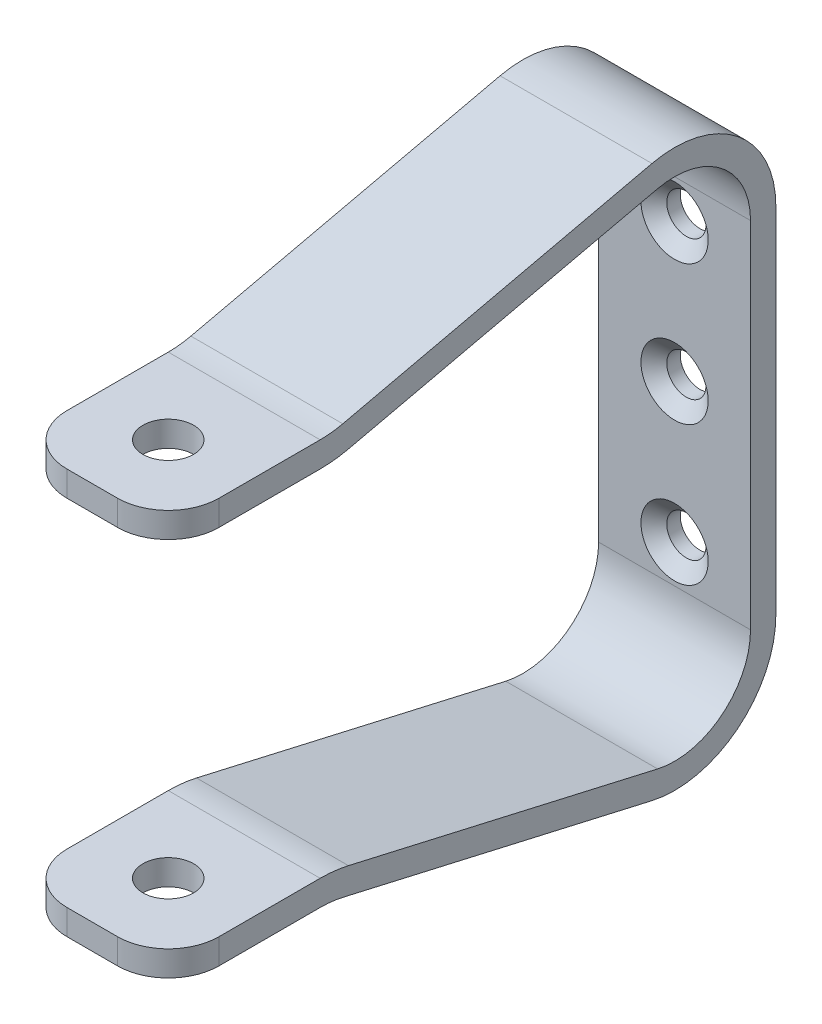
ISO-10303-21;
HEADER;
FILE_DESCRIPTION(('STEP AP214'),'2;1');
FILE_NAME('part.step','',(''),(''),'','','');
FILE_SCHEMA(('AUTOMOTIVE_DESIGN { 1 0 10303 214 1 1 1 1 }'));
ENDSEC;
DATA;
#1=APPLICATION_CONTEXT('core data for automotive mechanical design processes');
#2=APPLICATION_PROTOCOL_DEFINITION('international standard','automotive_design',2000,#1);
#3=PRODUCT_CONTEXT('',#1,'mechanical');
#4=PRODUCT('Part','Part','',(#3));
#5=PRODUCT_RELATED_PRODUCT_CATEGORY('part','',(#4));
#6=PRODUCT_DEFINITION_FORMATION('','',#4);
#7=PRODUCT_DEFINITION_CONTEXT('part definition',#1,'design');
#8=PRODUCT_DEFINITION('design','',#6,#7);
#9=PRODUCT_DEFINITION_SHAPE('','',#8);
#10=(LENGTH_UNIT() NAMED_UNIT(*) SI_UNIT(.MILLI.,.METRE.));
#11=(NAMED_UNIT(*) PLANE_ANGLE_UNIT() SI_UNIT($,.RADIAN.));
#12=(NAMED_UNIT(*) SI_UNIT($,.STERADIAN.) SOLID_ANGLE_UNIT());
#13=UNCERTAINTY_MEASURE_WITH_UNIT(LENGTH_MEASURE(1.E-05),#10,'distance_accuracy_value','');
#14=(GEOMETRIC_REPRESENTATION_CONTEXT(3) GLOBAL_UNCERTAINTY_ASSIGNED_CONTEXT((#13)) GLOBAL_UNIT_ASSIGNED_CONTEXT((#10,
#11,#12)) REPRESENTATION_CONTEXT('',''));
#15=CARTESIAN_POINT('',(0.,0.,0.));
#16=DIRECTION('',(0.,0.,1.));
#17=DIRECTION('',(1.,0.,0.));
#18=AXIS2_PLACEMENT_3D('',#15,#16,#17);
#19=CARTESIAN_POINT('',(9.52499999999998,25.4,57.15));
#20=DIRECTION('',(0.,-1.,0.));
#21=DIRECTION('',(1.,0.,0.));
#22=AXIS2_PLACEMENT_3D('',#19,#20,#21);
#23=PLANE('',#22);
#24=CARTESIAN_POINT('',(0.,25.4,66.675));
#25=DIRECTION('',(0.,-1.,0.));
#26=DIRECTION('',(1.,0.,0.));
#27=AXIS2_PLACEMENT_3D('',#24,#25,#26);
#28=CIRCLE('',#27,3.175);
#29=CARTESIAN_POINT('',(3.175,25.4,66.675));
#30=VERTEX_POINT('',#29);
#31=EDGE_CURVE('E245',#30,#30,#28,.T.);
#32=ORIENTED_EDGE('',*,*,#31,.T.);
#33=EDGE_LOOP('',(#32));
#34=FACE_BOUND('',#33,.T.);
#35=DIRECTION('',(-1.,0.,0.));
#36=VECTOR('',#35,1.);
#37=CARTESIAN_POINT('',(9.52499999999997,25.4,76.2));
#38=LINE('',#37,#36);
#39=CARTESIAN_POINT('',(3.17499999999997,25.4,76.2));
#40=VERTEX_POINT('',#39);
#41=CARTESIAN_POINT('',(-3.17500000000003,25.4,76.2));
#42=VERTEX_POINT('',#41);
#43=EDGE_CURVE('E353',#40,#42,#38,.T.);
#44=ORIENTED_EDGE('',*,*,#43,.F.);
#45=CARTESIAN_POINT('',(3.17499999999997,25.4,69.85));
#46=DIRECTION('',(0.,-1.,0.));
#47=DIRECTION('',(1.,0.,0.));
#48=AXIS2_PLACEMENT_3D('',#45,#46,#47);
#49=CIRCLE('',#48,6.35);
#50=CARTESIAN_POINT('',(9.52499999999997,25.4,69.85));
#51=VERTEX_POINT('',#50);
#52=EDGE_CURVE('E368',#40,#51,#49,.F.);
#53=ORIENTED_EDGE('',*,*,#52,.T.);
#54=DIRECTION('',(0.,0.,1.));
#55=VECTOR('',#54,1.);
#56=CARTESIAN_POINT('',(9.52499999999998,25.4,57.15));
#57=LINE('',#56,#55);
#58=CARTESIAN_POINT('',(9.52499999999998,25.4,57.15));
#59=VERTEX_POINT('',#58);
#60=EDGE_CURVE('E275',#59,#51,#57,.T.);
#61=ORIENTED_EDGE('',*,*,#60,.F.);
#62=DIRECTION('',(-1.,0.,0.));
#63=VECTOR('',#62,1.);
#64=CARTESIAN_POINT('',(9.52499999999998,25.4,57.15));
#65=LINE('',#64,#63);
#66=CARTESIAN_POINT('',(-9.52500000000002,25.4,57.15));
#67=VERTEX_POINT('',#66);
#68=EDGE_CURVE('E301',#59,#67,#65,.T.);
#69=ORIENTED_EDGE('',*,*,#68,.T.);
#70=DIRECTION('',(0.,0.,1.));
#71=VECTOR('',#70,1.);
#72=CARTESIAN_POINT('',(-9.52500000000002,25.4,57.15));
#73=LINE('',#72,#71);
#74=CARTESIAN_POINT('',(-9.52500000000003,25.4,69.85));
#75=VERTEX_POINT('',#74);
#76=EDGE_CURVE('E209',#67,#75,#73,.T.);
#77=ORIENTED_EDGE('',*,*,#76,.T.);
#78=CARTESIAN_POINT('',(-3.17500000000003,25.4,69.85));
#79=DIRECTION('',(0.,-1.,0.));
#80=DIRECTION('',(1.,0.,0.));
#81=AXIS2_PLACEMENT_3D('',#78,#79,#80);
#82=CIRCLE('',#81,6.35);
#83=EDGE_CURVE('E366',#75,#42,#82,.F.);
#84=ORIENTED_EDGE('',*,*,#83,.T.);
#85=EDGE_LOOP('',(#44,#53,#61,#69,#77,#84));
#86=FACE_BOUND('',#85,.T.);
#87=ADVANCED_FACE('F37',(#34,#86),#23,.F.);
#88=CARTESIAN_POINT('',(9.52499999999997,22.225,76.2));
#89=DIRECTION('',(0.,0.,1.));
#90=DIRECTION('',(1.,0.,0.));
#91=AXIS2_PLACEMENT_3D('',#88,#89,#90);
#92=PLANE('',#91);
#93=DIRECTION('',(-1.,0.,0.));
#94=VECTOR('',#93,1.);
#95=CARTESIAN_POINT('',(9.52499999999997,22.225,76.2));
#96=LINE('',#95,#94);
#97=CARTESIAN_POINT('',(3.17499999999997,22.225,76.2));
#98=VERTEX_POINT('',#97);
#99=CARTESIAN_POINT('',(-3.17500000000003,22.225,76.2));
#100=VERTEX_POINT('',#99);
#101=EDGE_CURVE('E350',#98,#100,#96,.T.);
#102=ORIENTED_EDGE('',*,*,#101,.F.);
#103=DIRECTION('',(0.,1.,0.));
#104=VECTOR('',#103,1.);
#105=CARTESIAN_POINT('',(3.17499999999997,22.225,76.2));
#106=LINE('',#105,#104);
#107=EDGE_CURVE('E363',#98,#40,#106,.T.);
#108=ORIENTED_EDGE('',*,*,#107,.T.);
#109=ORIENTED_EDGE('',*,*,#43,.T.);
#110=DIRECTION('',(0.,1.,0.));
#111=VECTOR('',#110,1.);
#112=CARTESIAN_POINT('',(-3.17500000000003,22.225,76.2));
#113=LINE('',#112,#111);
#114=EDGE_CURVE('E356',#42,#100,#113,.F.);
#115=ORIENTED_EDGE('',*,*,#114,.T.);
#116=EDGE_LOOP('',(#102,#108,#109,#115));
#117=FACE_BOUND('',#116,.T.);
#118=ADVANCED_FACE('F440',(#117),#92,.T.);
#119=CARTESIAN_POINT('',(9.52499999999998,22.225,57.15));
#120=DIRECTION('',(0.,-1.,0.));
#121=DIRECTION('',(1.,0.,0.));
#122=AXIS2_PLACEMENT_3D('',#119,#120,#121);
#123=PLANE('',#122);
#124=CARTESIAN_POINT('',(0.,22.225,66.675));
#125=DIRECTION('',(0.,-1.,0.));
#126=DIRECTION('',(1.,0.,0.));
#127=AXIS2_PLACEMENT_3D('',#124,#125,#126);
#128=CIRCLE('',#127,3.175);
#129=CARTESIAN_POINT('',(3.175,22.225,66.675));
#130=VERTEX_POINT('',#129);
#131=EDGE_CURVE('E360',#130,#130,#128,.T.);
#132=ORIENTED_EDGE('',*,*,#131,.F.);
#133=EDGE_LOOP('',(#132));
#134=FACE_BOUND('',#133,.T.);
#135=DIRECTION('',(0.,0.,1.));
#136=VECTOR('',#135,1.);
#137=CARTESIAN_POINT('',(9.52499999999998,22.225,57.15));
#138=LINE('',#137,#136);
#139=CARTESIAN_POINT('',(9.52499999999998,22.225,57.15));
#140=VERTEX_POINT('',#139);
#141=CARTESIAN_POINT('',(9.52499999999997,22.225,69.85));
#142=VERTEX_POINT('',#141);
#143=EDGE_CURVE('E277',#140,#142,#138,.T.);
#144=ORIENTED_EDGE('',*,*,#143,.T.);
#145=CARTESIAN_POINT('',(3.17499999999997,22.225,69.85));
#146=DIRECTION('',(0.,-1.,0.));
#147=DIRECTION('',(1.,0.,0.));
#148=AXIS2_PLACEMENT_3D('',#145,#146,#147);
#149=CIRCLE('',#148,6.35);
#150=EDGE_CURVE('E375',#142,#98,#149,.T.);
#151=ORIENTED_EDGE('',*,*,#150,.T.);
#152=ORIENTED_EDGE('',*,*,#101,.T.);
#153=CARTESIAN_POINT('',(-3.17500000000003,22.225,69.85));
#154=DIRECTION('',(0.,-1.,0.));
#155=DIRECTION('',(1.,0.,0.));
#156=AXIS2_PLACEMENT_3D('',#153,#154,#155);
#157=CIRCLE('',#156,6.35);
#158=CARTESIAN_POINT('',(-9.52500000000003,22.225,69.85));
#159=VERTEX_POINT('',#158);
#160=EDGE_CURVE('E373',#100,#159,#157,.T.);
#161=ORIENTED_EDGE('',*,*,#160,.T.);
#162=DIRECTION('',(0.,0.,1.));
#163=VECTOR('',#162,1.);
#164=CARTESIAN_POINT('',(-9.52500000000002,22.225,57.15));
#165=LINE('',#164,#163);
#166=CARTESIAN_POINT('',(-9.52500000000002,22.225,57.15));
#167=VERTEX_POINT('',#166);
#168=EDGE_CURVE('E304',#167,#159,#165,.T.);
#169=ORIENTED_EDGE('',*,*,#168,.F.);
#170=DIRECTION('',(-1.,0.,0.));
#171=VECTOR('',#170,1.);
#172=CARTESIAN_POINT('',(9.52499999999998,22.225,57.15));
#173=LINE('',#172,#171);
#174=EDGE_CURVE('E348',#140,#167,#173,.T.);
#175=ORIENTED_EDGE('',*,*,#174,.F.);
#176=EDGE_LOOP('',(#144,#151,#152,#161,#169,#175));
#177=FACE_BOUND('',#176,.T.);
#178=ADVANCED_FACE('F444',(#134,#177),#123,.T.);
#179=CARTESIAN_POINT('',(9.52499999999998,38.1,57.15));
#180=DIRECTION('',(-1.,0.,0.));
#181=DIRECTION('',(0.,0.,1.));
#182=AXIS2_PLACEMENT_3D('',#179,#180,#181);
#183=CYLINDRICAL_SURFACE('',#182,15.875);
#184=CARTESIAN_POINT('',(-9.52500000000003,38.1,57.15));
#185=DIRECTION('',(1.,0.,0.));
#186=DIRECTION('',(0.,-1.,0.));
#187=AXIS2_PLACEMENT_3D('',#184,#185,#186);
#188=CIRCLE('',#187,15.875);
#189=CARTESIAN_POINT('',(-9.52500000000002,22.6258619088462,53.6050493182692));
#190=VERTEX_POINT('',#189);
#191=EDGE_CURVE('E307',#190,#167,#188,.F.);
#192=ORIENTED_EDGE('',*,*,#191,.F.);
#193=DIRECTION('',(-1.,0.,0.));
#194=VECTOR('',#193,1.);
#195=CARTESIAN_POINT('',(9.52499999999998,22.6258619088462,53.6050493182692));
#196=LINE('',#195,#194);
#197=CARTESIAN_POINT('',(9.52499999999998,22.6258619088462,53.6050493182692));
#198=VERTEX_POINT('',#197);
#199=EDGE_CURVE('E346',#198,#190,#196,.T.);
#200=ORIENTED_EDGE('',*,*,#199,.F.);
#201=CARTESIAN_POINT('',(9.52499999999998,38.1,57.15));
#202=DIRECTION('',(1.,0.,0.));
#203=DIRECTION('',(0.,-1.,0.));
#204=AXIS2_PLACEMENT_3D('',#201,#202,#203);
#205=CIRCLE('',#204,15.875);
#206=EDGE_CURVE('E281',#198,#140,#205,.F.);
#207=ORIENTED_EDGE('',*,*,#206,.T.);
#208=ORIENTED_EDGE('',*,*,#174,.T.);
#209=EDGE_LOOP('',(#192,#200,#207,#208));
#210=FACE_BOUND('',#209,.T.);
#211=ADVANCED_FACE('F454',(#210),#183,.T.);
#212=CARTESIAN_POINT('',(9.525,31.5094828546923,14.8269704090385));
#213=DIRECTION('',(0.,-0.974748856135671,-0.223303979951546));
#214=DIRECTION('',(0.,0.223303979951546,-0.974748856135671));
#215=AXIS2_PLACEMENT_3D('',#212,#213,#214);
#216=PLANE('',#215);
#217=DIRECTION('',(0.,-0.223303979951546,0.974748856135671));
#218=VECTOR('',#217,1.);
#219=CARTESIAN_POINT('',(-9.525,31.5094828546922,14.8269704090385));
#220=LINE('',#219,#218);
#221=CARTESIAN_POINT('',(-9.525,31.5094828546922,14.8269704090385));
#222=VERTEX_POINT('',#221);
#223=EDGE_CURVE('E310',#222,#190,#220,.T.);
#224=ORIENTED_EDGE('',*,*,#223,.F.);
#225=DIRECTION('',(-1.,0.,0.));
#226=VECTOR('',#225,1.);
#227=CARTESIAN_POINT('',(9.525,31.5094828546923,14.8269704090385));
#228=LINE('',#227,#226);
#229=CARTESIAN_POINT('',(9.525,31.5094828546923,14.8269704090385));
#230=VERTEX_POINT('',#229);
#231=EDGE_CURVE('E344',#230,#222,#228,.T.);
#232=ORIENTED_EDGE('',*,*,#231,.F.);
#233=DIRECTION('',(0.,-0.223303979951546,0.974748856135671));
#234=VECTOR('',#233,1.);
#235=CARTESIAN_POINT('',(9.525,31.5094828546923,14.8269704090385));
#236=LINE('',#235,#234);
#237=EDGE_CURVE('E284',#230,#198,#236,.T.);
#238=ORIENTED_EDGE('',*,*,#237,.T.);
#239=ORIENTED_EDGE('',*,*,#199,.T.);
#240=EDGE_LOOP('',(#224,#232,#238,#239));
#241=FACE_BOUND('',#240,.T.);
#242=ADVANCED_FACE('F457',(#241),#216,.T.);
#243=CARTESIAN_POINT('',(9.525,22.225,12.7));
#244=DIRECTION('',(-1.,0.,0.));
#245=DIRECTION('',(0.,0.,1.));
#246=AXIS2_PLACEMENT_3D('',#243,#244,#245);
#247=CYLINDRICAL_SURFACE('',#246,9.525);
#248=CARTESIAN_POINT('',(-9.525,22.225,12.7));
#249=DIRECTION('',(1.,0.,0.));
#250=DIRECTION('',(0.,-1.,0.));
#251=AXIS2_PLACEMENT_3D('',#248,#249,#250);
#252=CIRCLE('',#251,9.525);
#253=CARTESIAN_POINT('',(-9.52499999999999,22.225,3.17500000000001));
#254=VERTEX_POINT('',#253);
#255=EDGE_CURVE('E313',#254,#222,#252,.T.);
#256=ORIENTED_EDGE('',*,*,#255,.F.);
#257=DIRECTION('',(-1.,0.,0.));
#258=VECTOR('',#257,1.);
#259=CARTESIAN_POINT('',(9.52500000000001,22.225,3.17500000000002));
#260=LINE('',#259,#258);
#261=CARTESIAN_POINT('',(9.52500000000001,22.225,3.17500000000002));
#262=VERTEX_POINT('',#261);
#263=EDGE_CURVE('E342',#262,#254,#260,.T.);
#264=ORIENTED_EDGE('',*,*,#263,.F.);
#265=CARTESIAN_POINT('',(9.525,22.225,12.7));
#266=DIRECTION('',(1.,0.,0.));
#267=DIRECTION('',(0.,-1.,0.));
#268=AXIS2_PLACEMENT_3D('',#265,#266,#267);
#269=CIRCLE('',#268,9.525);
#270=EDGE_CURVE('E287',#262,#230,#269,.T.);
#271=ORIENTED_EDGE('',*,*,#270,.T.);
#272=ORIENTED_EDGE('',*,*,#231,.T.);
#273=EDGE_LOOP('',(#256,#264,#271,#272));
#274=FACE_BOUND('',#273,.T.);
#275=ADVANCED_FACE('F462',(#274),#247,.F.);
#276=CARTESIAN_POINT('',(9.52500000000001,22.225,3.17500000000002));
#277=DIRECTION('',(0.,0.,1.));
#278=DIRECTION('',(1.,0.,0.));
#279=AXIS2_PLACEMENT_3D('',#276,#277,#278);
#280=PLANE('',#279);
#281=CARTESIAN_POINT('',(0.,-17.4625,3.175));
#282=DIRECTION('',(0.,0.,1.));
#283=DIRECTION('',(0.,-1.,0.));
#284=AXIS2_PLACEMENT_3D('',#281,#282,#283);
#285=CIRCLE('',#284,4.2164);
#286=CARTESIAN_POINT('',(0.,-21.6789,3.175));
#287=VERTEX_POINT('',#286);
#288=EDGE_CURVE('E880',#287,#287,#285,.T.);
#289=ORIENTED_EDGE('',*,*,#288,.F.);
#290=EDGE_LOOP('',(#289));
#291=FACE_BOUND('',#290,.T.);
#292=CARTESIAN_POINT('',(0.,0.,3.175));
#293=DIRECTION('',(0.,0.,1.));
#294=DIRECTION('',(0.,-1.,0.));
#295=AXIS2_PLACEMENT_3D('',#292,#293,#294);
#296=CIRCLE('',#295,4.2164);
#297=CARTESIAN_POINT('',(0.,-4.2164,3.175));
#298=VERTEX_POINT('',#297);
#299=EDGE_CURVE('E871',#298,#298,#296,.T.);
#300=ORIENTED_EDGE('',*,*,#299,.F.);
#301=EDGE_LOOP('',(#300));
#302=FACE_BOUND('',#301,.T.);
#303=CARTESIAN_POINT('',(0.,17.4625,3.175));
#304=DIRECTION('',(0.,0.,1.));
#305=DIRECTION('',(0.,-1.,0.));
#306=AXIS2_PLACEMENT_3D('',#303,#304,#305);
#307=CIRCLE('',#306,4.2164);
#308=CARTESIAN_POINT('',(0.,13.2461,3.175));
#309=VERTEX_POINT('',#308);
#310=EDGE_CURVE('E862',#309,#309,#307,.T.);
#311=ORIENTED_EDGE('',*,*,#310,.F.);
#312=EDGE_LOOP('',(#311));
#313=FACE_BOUND('',#312,.T.);
#314=DIRECTION('',(0.,1.,0.));
#315=VECTOR('',#314,1.);
#316=CARTESIAN_POINT('',(-9.52499999999999,22.225,3.17500000000001));
#317=LINE('',#316,#315);
#318=CARTESIAN_POINT('',(-9.52499999999999,-22.225,3.17500000000001));
#319=VERTEX_POINT('',#318);
#320=EDGE_CURVE('E316',#319,#254,#317,.T.);
#321=ORIENTED_EDGE('',*,*,#320,.F.);
#322=DIRECTION('',(-1.,0.,0.));
#323=VECTOR('',#322,1.);
#324=CARTESIAN_POINT('',(9.52500000000002,-22.225,3.17500000000002));
#325=LINE('',#324,#323);
#326=CARTESIAN_POINT('',(9.52500000000001,-22.225,3.17500000000002));
#327=VERTEX_POINT('',#326);
#328=EDGE_CURVE('E340',#327,#319,#325,.T.);
#329=ORIENTED_EDGE('',*,*,#328,.F.);
#330=DIRECTION('',(0.,1.,0.));
#331=VECTOR('',#330,1.);
#332=CARTESIAN_POINT('',(9.52500000000001,22.225,3.17500000000002));
#333=LINE('',#332,#331);
#334=EDGE_CURVE('E290',#327,#262,#333,.T.);
#335=ORIENTED_EDGE('',*,*,#334,.T.);
#336=ORIENTED_EDGE('',*,*,#263,.T.);
#337=EDGE_LOOP('',(#321,#329,#335,#336));
#338=FACE_BOUND('',#337,.T.);
#339=ADVANCED_FACE('F465',(#291,#302,#313,#338),#280,.T.);
#340=CARTESIAN_POINT('',(9.52500000000001,22.225,0.));
#341=DIRECTION('',(0.,0.,1.));
#342=DIRECTION('',(1.,0.,0.));
#343=AXIS2_PLACEMENT_3D('',#340,#341,#342);
#344=PLANE('',#343);
#345=CARTESIAN_POINT('',(0.,-17.4625,0.));
#346=DIRECTION('',(0.,0.,1.));
#347=DIRECTION('',(0.,-1.,0.));
#348=AXIS2_PLACEMENT_3D('',#345,#346,#347);
#349=CIRCLE('',#348,2.45745);
#350=CARTESIAN_POINT('',(0.,-19.91995,0.));
#351=VERTEX_POINT('',#350);
#352=EDGE_CURVE('E874',#351,#351,#349,.T.);
#353=ORIENTED_EDGE('',*,*,#352,.T.);
#354=EDGE_LOOP('',(#353));
#355=FACE_BOUND('',#354,.T.);
#356=CARTESIAN_POINT('',(0.,0.,0.));
#357=DIRECTION('',(0.,0.,1.));
#358=DIRECTION('',(0.,-1.,0.));
#359=AXIS2_PLACEMENT_3D('',#356,#357,#358);
#360=CIRCLE('',#359,2.45745);
#361=CARTESIAN_POINT('',(0.,-2.45745,0.));
#362=VERTEX_POINT('',#361);
#363=EDGE_CURVE('E865',#362,#362,#360,.T.);
#364=ORIENTED_EDGE('',*,*,#363,.T.);
#365=EDGE_LOOP('',(#364));
#366=FACE_BOUND('',#365,.T.);
#367=CARTESIAN_POINT('',(0.,17.4625,0.));
#368=DIRECTION('',(0.,0.,1.));
#369=DIRECTION('',(0.,-1.,0.));
#370=AXIS2_PLACEMENT_3D('',#367,#368,#369);
#371=CIRCLE('',#370,2.45745);
#372=CARTESIAN_POINT('',(0.,15.00505,0.));
#373=VERTEX_POINT('',#372);
#374=EDGE_CURVE('E849',#373,#373,#371,.T.);
#375=ORIENTED_EDGE('',*,*,#374,.T.);
#376=EDGE_LOOP('',(#375));
#377=FACE_BOUND('',#376,.T.);
#378=DIRECTION('',(0.,1.,0.));
#379=VECTOR('',#378,1.);
#380=CARTESIAN_POINT('',(-9.52499999999999,22.225,0.));
#381=LINE('',#380,#379);
#382=CARTESIAN_POINT('',(-9.52499999999998,-22.225,0.));
#383=VERTEX_POINT('',#382);
#384=CARTESIAN_POINT('',(-9.52499999999999,22.225,0.));
#385=VERTEX_POINT('',#384);
#386=EDGE_CURVE('E319',#383,#385,#381,.T.);
#387=ORIENTED_EDGE('',*,*,#386,.T.);
#388=DIRECTION('',(-1.,0.,0.));
#389=VECTOR('',#388,1.);
#390=CARTESIAN_POINT('',(9.52500000000001,22.225,0.));
#391=LINE('',#390,#389);
#392=CARTESIAN_POINT('',(9.52500000000001,22.225,0.));
#393=VERTEX_POINT('',#392);
#394=EDGE_CURVE('E334',#393,#385,#391,.T.);
#395=ORIENTED_EDGE('',*,*,#394,.F.);
#396=DIRECTION('',(0.,1.,0.));
#397=VECTOR('',#396,1.);
#398=CARTESIAN_POINT('',(9.52500000000001,22.225,0.));
#399=LINE('',#398,#397);
#400=CARTESIAN_POINT('',(9.52500000000001,-22.225,0.));
#401=VERTEX_POINT('',#400);
#402=EDGE_CURVE('E293',#401,#393,#399,.T.);
#403=ORIENTED_EDGE('',*,*,#402,.F.);
#404=DIRECTION('',(-1.,0.,0.));
#405=VECTOR('',#404,1.);
#406=CARTESIAN_POINT('',(9.52500000000002,-22.225,0.));
#407=LINE('',#406,#405);
#408=EDGE_CURVE('E337',#401,#383,#407,.T.);
#409=ORIENTED_EDGE('',*,*,#408,.T.);
#410=EDGE_LOOP('',(#387,#395,#403,#409));
#411=FACE_BOUND('',#410,.T.);
#412=ADVANCED_FACE('F412',(#355,#366,#377,#411),#344,.F.);
#413=CARTESIAN_POINT('',(9.525,22.225,12.7));
#414=DIRECTION('',(-1.,0.,0.));
#415=DIRECTION('',(0.,0.,1.));
#416=AXIS2_PLACEMENT_3D('',#413,#414,#415);
#417=CYLINDRICAL_SURFACE('',#416,12.7);
#418=CARTESIAN_POINT('',(-9.525,22.225,12.7));
#419=DIRECTION('',(1.,0.,0.));
#420=DIRECTION('',(0.,0.,-1.));
#421=AXIS2_PLACEMENT_3D('',#418,#419,#420);
#422=CIRCLE('',#421,12.7);
#423=CARTESIAN_POINT('',(-9.525,34.604310472923,15.5359605453847));
#424=VERTEX_POINT('',#423);
#425=EDGE_CURVE('E321',#385,#424,#422,.T.);
#426=ORIENTED_EDGE('',*,*,#425,.T.);
#427=DIRECTION('',(-1.,0.,0.));
#428=VECTOR('',#427,1.);
#429=CARTESIAN_POINT('',(9.525,34.604310472923,15.5359605453847));
#430=LINE('',#429,#428);
#431=CARTESIAN_POINT('',(9.525,34.604310472923,15.5359605453847));
#432=VERTEX_POINT('',#431);
#433=EDGE_CURVE('E331',#432,#424,#430,.T.);
#434=ORIENTED_EDGE('',*,*,#433,.F.);
#435=CARTESIAN_POINT('',(9.525,22.225,12.7));
#436=DIRECTION('',(1.,0.,0.));
#437=DIRECTION('',(0.,0.,-1.));
#438=AXIS2_PLACEMENT_3D('',#435,#436,#437);
#439=CIRCLE('',#438,12.7);
#440=EDGE_CURVE('E295',#393,#432,#439,.T.);
#441=ORIENTED_EDGE('',*,*,#440,.F.);
#442=ORIENTED_EDGE('',*,*,#394,.T.);
#443=EDGE_LOOP('',(#426,#434,#441,#442));
#444=FACE_BOUND('',#443,.T.);
#445=ADVANCED_FACE('F419',(#444),#417,.T.);
#446=CARTESIAN_POINT('',(9.525,34.604310472923,15.5359605453847));
#447=DIRECTION('',(0.,-0.974748856135671,-0.223303979951546));
#448=DIRECTION('',(0.,0.223303979951546,-0.974748856135671));
#449=AXIS2_PLACEMENT_3D('',#446,#447,#448);
#450=PLANE('',#449);
#451=DIRECTION('',(0.,-0.223303979951546,0.974748856135671));
#452=VECTOR('',#451,1.);
#453=CARTESIAN_POINT('',(-9.525,34.604310472923,15.5359605453847));
#454=LINE('',#453,#452);
#455=CARTESIAN_POINT('',(-9.52500000000002,25.7206895270769,54.3140394546154));
#456=VERTEX_POINT('',#455);
#457=EDGE_CURVE('E323',#424,#456,#454,.T.);
#458=ORIENTED_EDGE('',*,*,#457,.T.);
#459=DIRECTION('',(-1.,0.,0.));
#460=VECTOR('',#459,1.);
#461=CARTESIAN_POINT('',(9.52499999999998,25.7206895270769,54.3140394546154));
#462=LINE('',#461,#460);
#463=CARTESIAN_POINT('',(9.52499999999998,25.7206895270769,54.3140394546154));
#464=VERTEX_POINT('',#463);
#465=EDGE_CURVE('E328',#464,#456,#462,.T.);
#466=ORIENTED_EDGE('',*,*,#465,.F.);
#467=DIRECTION('',(0.,-0.223303979951546,0.974748856135671));
#468=VECTOR('',#467,1.);
#469=CARTESIAN_POINT('',(9.525,34.604310472923,15.5359605453847));
#470=LINE('',#469,#468);
#471=EDGE_CURVE('E297',#432,#464,#470,.T.);
#472=ORIENTED_EDGE('',*,*,#471,.F.);
#473=ORIENTED_EDGE('',*,*,#433,.T.);
#474=EDGE_LOOP('',(#458,#466,#472,#473));
#475=FACE_BOUND('',#474,.T.);
#476=ADVANCED_FACE('F423',(#475),#450,.F.);
#477=CARTESIAN_POINT('',(9.52499999999998,38.1,57.15));
#478=DIRECTION('',(-1.,0.,0.));
#479=DIRECTION('',(0.,0.,1.));
#480=AXIS2_PLACEMENT_3D('',#477,#478,#479);
#481=CYLINDRICAL_SURFACE('',#480,12.7);
#482=CARTESIAN_POINT('',(-9.52500000000003,38.1,57.15));
#483=DIRECTION('',(-1.,0.,0.));
#484=DIRECTION('',(0.,0.,1.));
#485=AXIS2_PLACEMENT_3D('',#482,#483,#484);
#486=CIRCLE('',#485,12.7);
#487=EDGE_CURVE('E278',#456,#67,#486,.T.);
#488=ORIENTED_EDGE('',*,*,#487,.T.);
#489=ORIENTED_EDGE('',*,*,#68,.F.);
#490=CARTESIAN_POINT('',(9.52499999999998,38.1,57.15));
#491=DIRECTION('',(-1.,0.,0.));
#492=DIRECTION('',(0.,0.,1.));
#493=AXIS2_PLACEMENT_3D('',#490,#491,#492);
#494=CIRCLE('',#493,12.7);
#495=EDGE_CURVE('E299',#464,#59,#494,.T.);
#496=ORIENTED_EDGE('',*,*,#495,.F.);
#497=ORIENTED_EDGE('',*,*,#465,.T.);
#498=EDGE_LOOP('',(#488,#489,#496,#497));
#499=FACE_BOUND('',#498,.T.);
#500=ADVANCED_FACE('F430',(#499),#481,.F.);
#501=CARTESIAN_POINT('',(9.52499999999998,38.1,57.15));
#502=DIRECTION('',(1.,0.,0.));
#503=DIRECTION('',(0.,-1.,0.));
#504=AXIS2_PLACEMENT_3D('',#501,#502,#503);
#505=PLANE('',#504);
#506=ORIENTED_EDGE('',*,*,#60,.T.);
#507=DIRECTION('',(0.,1.,0.));
#508=VECTOR('',#507,1.);
#509=CARTESIAN_POINT('',(9.52499999999997,38.1,69.85));
#510=LINE('',#509,#508);
#511=EDGE_CURVE('E371',#51,#142,#510,.F.);
#512=ORIENTED_EDGE('',*,*,#511,.T.);
#513=ORIENTED_EDGE('',*,*,#143,.F.);
#514=ORIENTED_EDGE('',*,*,#206,.F.);
#515=ORIENTED_EDGE('',*,*,#237,.F.);
#516=ORIENTED_EDGE('',*,*,#270,.F.);
#517=ORIENTED_EDGE('',*,*,#334,.F.);
#518=CARTESIAN_POINT('',(9.525,-22.225,12.7));
#519=DIRECTION('',(-1.,0.,0.));
#520=DIRECTION('',(0.,1.,0.));
#521=AXIS2_PLACEMENT_3D('',#518,#519,#520);
#522=CIRCLE('',#521,9.525);
#523=CARTESIAN_POINT('',(9.525,-31.5094828546923,14.8269704090385));
#524=VERTEX_POINT('',#523);
#525=EDGE_CURVE('E234',#327,#524,#522,.T.);
#526=ORIENTED_EDGE('',*,*,#525,.T.);
#527=DIRECTION('',(0.,0.223303979951546,0.974748856135671));
#528=VECTOR('',#527,1.);
#529=CARTESIAN_POINT('',(9.525,-31.5094828546923,14.8269704090385));
#530=LINE('',#529,#528);
#531=CARTESIAN_POINT('',(9.52499999999998,-22.6258619088462,53.6050493182692));
#532=VERTEX_POINT('',#531);
#533=EDGE_CURVE('E236',#524,#532,#530,.T.);
#534=ORIENTED_EDGE('',*,*,#533,.T.);
#535=CARTESIAN_POINT('',(9.52499999999998,-38.1,57.15));
#536=DIRECTION('',(-1.,0.,0.));
#537=DIRECTION('',(0.,1.,0.));
#538=AXIS2_PLACEMENT_3D('',#535,#536,#537);
#539=CIRCLE('',#538,15.875);
#540=CARTESIAN_POINT('',(9.52499999999998,-22.225,57.15));
#541=VERTEX_POINT('',#540);
#542=EDGE_CURVE('E238',#532,#541,#539,.F.);
#543=ORIENTED_EDGE('',*,*,#542,.T.);
#544=DIRECTION('',(0.,0.,1.));
#545=VECTOR('',#544,1.);
#546=CARTESIAN_POINT('',(9.52499999999998,-22.225,57.15));
#547=LINE('',#546,#545);
#548=CARTESIAN_POINT('',(9.52499999999997,-22.225,69.85));
#549=VERTEX_POINT('',#548);
#550=EDGE_CURVE('E240',#541,#549,#547,.T.);
#551=ORIENTED_EDGE('',*,*,#550,.T.);
#552=DIRECTION('',(0.,-1.,0.));
#553=VECTOR('',#552,1.);
#554=CARTESIAN_POINT('',(9.52499999999998,-25.4,69.85));
#555=LINE('',#554,#553);
#556=CARTESIAN_POINT('',(9.52499999999997,-25.4,69.85));
#557=VERTEX_POINT('',#556);
#558=EDGE_CURVE('E222',#549,#557,#555,.T.);
#559=ORIENTED_EDGE('',*,*,#558,.T.);
#560=DIRECTION('',(0.,0.,1.));
#561=VECTOR('',#560,1.);
#562=CARTESIAN_POINT('',(9.52499999999998,-25.4,57.15));
#563=LINE('',#562,#561);
#564=CARTESIAN_POINT('',(9.52499999999998,-25.4,57.15));
#565=VERTEX_POINT('',#564);
#566=EDGE_CURVE('E202',#565,#557,#563,.T.);
#567=ORIENTED_EDGE('',*,*,#566,.F.);
#568=CARTESIAN_POINT('',(9.52499999999998,-38.1,57.15));
#569=DIRECTION('',(1.,0.,0.));
#570=DIRECTION('',(0.,0.,1.));
#571=AXIS2_PLACEMENT_3D('',#568,#569,#570);
#572=CIRCLE('',#571,12.7);
#573=CARTESIAN_POINT('',(9.52499999999998,-25.7206895270769,54.3140394546154));
#574=VERTEX_POINT('',#573);
#575=EDGE_CURVE('E218',#574,#565,#572,.T.);
#576=ORIENTED_EDGE('',*,*,#575,.F.);
#577=DIRECTION('',(0.,0.223303979951546,0.974748856135671));
#578=VECTOR('',#577,1.);
#579=CARTESIAN_POINT('',(9.525,-34.604310472923,15.5359605453847));
#580=LINE('',#579,#578);
#581=CARTESIAN_POINT('',(9.525,-34.604310472923,15.5359605453847));
#582=VERTEX_POINT('',#581);
#583=EDGE_CURVE('E226',#582,#574,#580,.T.);
#584=ORIENTED_EDGE('',*,*,#583,.F.);
#585=CARTESIAN_POINT('',(9.525,-22.225,12.7));
#586=DIRECTION('',(-1.,0.,0.));
#587=DIRECTION('',(0.,0.,-1.));
#588=AXIS2_PLACEMENT_3D('',#585,#586,#587);
#589=CIRCLE('',#588,12.7);
#590=EDGE_CURVE('E228',#401,#582,#589,.T.);
#591=ORIENTED_EDGE('',*,*,#590,.F.);
#592=ORIENTED_EDGE('',*,*,#402,.T.);
#593=ORIENTED_EDGE('',*,*,#440,.T.);
#594=ORIENTED_EDGE('',*,*,#471,.T.);
#595=ORIENTED_EDGE('',*,*,#495,.T.);
#596=EDGE_LOOP('',(#506,#512,#513,#514,#515,#516,#517,#526,#534,#543,#551,#559,#567,#576,#584,
#591,#592,#593,#594,#595));
#597=FACE_BOUND('',#596,.T.);
#598=ADVANCED_FACE('F216',(#597),#505,.T.);
#599=CARTESIAN_POINT('',(-9.52500000000003,38.1,57.15));
#600=DIRECTION('',(1.,0.,0.));
#601=DIRECTION('',(0.,-1.,0.));
#602=AXIS2_PLACEMENT_3D('',#599,#600,#601);
#603=PLANE('',#602);
#604=ORIENTED_EDGE('',*,*,#168,.T.);
#605=DIRECTION('',(0.,1.,0.));
#606=VECTOR('',#605,1.);
#607=CARTESIAN_POINT('',(-9.52500000000003,25.4,69.85));
#608=LINE('',#607,#606);
#609=EDGE_CURVE('E379',#159,#75,#608,.T.);
#610=ORIENTED_EDGE('',*,*,#609,.T.);
#611=ORIENTED_EDGE('',*,*,#76,.F.);
#612=ORIENTED_EDGE('',*,*,#487,.F.);
#613=ORIENTED_EDGE('',*,*,#457,.F.);
#614=ORIENTED_EDGE('',*,*,#425,.F.);
#615=ORIENTED_EDGE('',*,*,#386,.F.);
#616=CARTESIAN_POINT('',(-9.525,-22.225,12.7));
#617=DIRECTION('',(-1.,0.,0.));
#618=DIRECTION('',(0.,0.,-1.));
#619=AXIS2_PLACEMENT_3D('',#616,#617,#618);
#620=CIRCLE('',#619,12.7);
#621=CARTESIAN_POINT('',(-9.525,-34.604310472923,15.5359605453847));
#622=VERTEX_POINT('',#621);
#623=EDGE_CURVE('E250',#383,#622,#620,.T.);
#624=ORIENTED_EDGE('',*,*,#623,.T.);
#625=DIRECTION('',(0.,0.223303979951546,0.974748856135671));
#626=VECTOR('',#625,1.);
#627=CARTESIAN_POINT('',(-9.525,-34.604310472923,15.5359605453847));
#628=LINE('',#627,#626);
#629=CARTESIAN_POINT('',(-9.52500000000002,-25.7206895270769,54.3140394546154));
#630=VERTEX_POINT('',#629);
#631=EDGE_CURVE('E247',#622,#630,#628,.T.);
#632=ORIENTED_EDGE('',*,*,#631,.T.);
#633=CARTESIAN_POINT('',(-9.52500000000003,-38.1,57.15));
#634=DIRECTION('',(1.,0.,0.));
#635=DIRECTION('',(0.,0.,1.));
#636=AXIS2_PLACEMENT_3D('',#633,#634,#635);
#637=CIRCLE('',#636,12.7);
#638=CARTESIAN_POINT('',(-9.52500000000002,-25.4,57.15));
#639=VERTEX_POINT('',#638);
#640=EDGE_CURVE('E244',#630,#639,#637,.T.);
#641=ORIENTED_EDGE('',*,*,#640,.T.);
#642=DIRECTION('',(0.,0.,1.));
#643=VECTOR('',#642,1.);
#644=CARTESIAN_POINT('',(-9.52500000000002,-25.4,57.15));
#645=LINE('',#644,#643);
#646=CARTESIAN_POINT('',(-9.52500000000003,-25.4,69.85));
#647=VERTEX_POINT('',#646);
#648=EDGE_CURVE('E204',#639,#647,#645,.T.);
#649=ORIENTED_EDGE('',*,*,#648,.T.);
#650=DIRECTION('',(0.,-1.,0.));
#651=VECTOR('',#650,1.);
#652=CARTESIAN_POINT('',(-9.52500000000003,38.1,69.85));
#653=LINE('',#652,#651);
#654=CARTESIAN_POINT('',(-9.52500000000003,-22.225,69.85));
#655=VERTEX_POINT('',#654);
#656=EDGE_CURVE('E377',#647,#655,#653,.F.);
#657=ORIENTED_EDGE('',*,*,#656,.T.);
#658=DIRECTION('',(0.,0.,1.));
#659=VECTOR('',#658,1.);
#660=CARTESIAN_POINT('',(-9.52500000000002,-22.225,57.15));
#661=LINE('',#660,#659);
#662=CARTESIAN_POINT('',(-9.52500000000002,-22.225,57.15));
#663=VERTEX_POINT('',#662);
#664=EDGE_CURVE('E223',#663,#655,#661,.T.);
#665=ORIENTED_EDGE('',*,*,#664,.F.);
#666=CARTESIAN_POINT('',(-9.52500000000003,-38.1,57.15));
#667=DIRECTION('',(-1.,0.,0.));
#668=DIRECTION('',(0.,1.,0.));
#669=AXIS2_PLACEMENT_3D('',#666,#667,#668);
#670=CIRCLE('',#669,15.875);
#671=CARTESIAN_POINT('',(-9.52500000000002,-22.6258619088462,53.6050493182692));
#672=VERTEX_POINT('',#671);
#673=EDGE_CURVE('E257',#672,#663,#670,.F.);
#674=ORIENTED_EDGE('',*,*,#673,.F.);
#675=DIRECTION('',(0.,0.223303979951546,0.974748856135671));
#676=VECTOR('',#675,1.);
#677=CARTESIAN_POINT('',(-9.525,-31.5094828546922,14.8269704090385));
#678=LINE('',#677,#676);
#679=CARTESIAN_POINT('',(-9.525,-31.5094828546922,14.8269704090385));
#680=VERTEX_POINT('',#679);
#681=EDGE_CURVE('E255',#680,#672,#678,.T.);
#682=ORIENTED_EDGE('',*,*,#681,.F.);
#683=CARTESIAN_POINT('',(-9.525,-22.225,12.7));
#684=DIRECTION('',(-1.,0.,0.));
#685=DIRECTION('',(0.,1.,0.));
#686=AXIS2_PLACEMENT_3D('',#683,#684,#685);
#687=CIRCLE('',#686,9.525);
#688=EDGE_CURVE('E253',#319,#680,#687,.T.);
#689=ORIENTED_EDGE('',*,*,#688,.F.);
#690=ORIENTED_EDGE('',*,*,#320,.T.);
#691=ORIENTED_EDGE('',*,*,#255,.T.);
#692=ORIENTED_EDGE('',*,*,#223,.T.);
#693=ORIENTED_EDGE('',*,*,#191,.T.);
#694=EDGE_LOOP('',(#604,#610,#611,#612,#613,#614,#615,#624,#632,#641,#649,#657,#665,#674,#682,
#689,#690,#691,#692,#693));
#695=FACE_BOUND('',#694,.T.);
#696=ADVANCED_FACE('F401',(#695),#603,.F.);
#697=CARTESIAN_POINT('',(9.52499999999998,-25.4,57.15));
#698=DIRECTION('',(0.,-1.,0.));
#699=DIRECTION('',(1.,0.,0.));
#700=AXIS2_PLACEMENT_3D('',#697,#698,#699);
#701=PLANE('',#700);
#702=CARTESIAN_POINT('',(0.,-25.4,66.675));
#703=DIRECTION('',(0.,-1.,0.));
#704=DIRECTION('',(0.,0.,-1.));
#705=AXIS2_PLACEMENT_3D('',#702,#703,#704);
#706=CIRCLE('',#705,3.175);
#707=CARTESIAN_POINT('',(0.,-25.4,63.5));
#708=VERTEX_POINT('',#707);
#709=EDGE_CURVE('E361',#708,#708,#706,.T.);
#710=ORIENTED_EDGE('',*,*,#709,.F.);
#711=EDGE_LOOP('',(#710));
#712=FACE_BOUND('',#711,.T.);
#713=DIRECTION('',(-1.,0.,0.));
#714=VECTOR('',#713,1.);
#715=CARTESIAN_POINT('',(9.52499999999997,-25.4,76.2));
#716=LINE('',#715,#714);
#717=CARTESIAN_POINT('',(3.17499999999998,-25.4,76.2));
#718=VERTEX_POINT('',#717);
#719=CARTESIAN_POINT('',(-3.17500000000002,-25.4,76.2));
#720=VERTEX_POINT('',#719);
#721=EDGE_CURVE('E242',#718,#720,#716,.T.);
#722=ORIENTED_EDGE('',*,*,#721,.T.);
#723=CARTESIAN_POINT('',(-3.17500000000002,-25.4,69.85));
#724=DIRECTION('',(0.,-1.,0.));
#725=DIRECTION('',(1.,0.,0.));
#726=AXIS2_PLACEMENT_3D('',#723,#724,#725);
#727=CIRCLE('',#726,6.35);
#728=EDGE_CURVE('E388',#720,#647,#727,.T.);
#729=ORIENTED_EDGE('',*,*,#728,.T.);
#730=ORIENTED_EDGE('',*,*,#648,.F.);
#731=DIRECTION('',(-1.,0.,0.));
#732=VECTOR('',#731,1.);
#733=CARTESIAN_POINT('',(9.52499999999998,-25.4,57.15));
#734=LINE('',#733,#732);
#735=EDGE_CURVE('E198',#565,#639,#734,.T.);
#736=ORIENTED_EDGE('',*,*,#735,.F.);
#737=ORIENTED_EDGE('',*,*,#566,.T.);
#738=CARTESIAN_POINT('',(3.17499999999999,-25.4,69.85));
#739=DIRECTION('',(0.,-1.,0.));
#740=DIRECTION('',(1.,0.,0.));
#741=AXIS2_PLACEMENT_3D('',#738,#739,#740);
#742=CIRCLE('',#741,6.35);
#743=EDGE_CURVE('E386',#557,#718,#742,.T.);
#744=ORIENTED_EDGE('',*,*,#743,.T.);
#745=EDGE_LOOP('',(#722,#729,#730,#736,#737,#744));
#746=FACE_BOUND('',#745,.T.);
#747=ADVANCED_FACE('F201',(#712,#746),#701,.T.);
#748=CARTESIAN_POINT('',(9.52499999999998,-38.1,57.15));
#749=DIRECTION('',(-1.,0.,0.));
#750=DIRECTION('',(0.,0.,1.));
#751=AXIS2_PLACEMENT_3D('',#748,#749,#750);
#752=CYLINDRICAL_SURFACE('',#751,12.7);
#753=ORIENTED_EDGE('',*,*,#640,.F.);
#754=DIRECTION('',(-1.,0.,0.));
#755=VECTOR('',#754,1.);
#756=CARTESIAN_POINT('',(9.52499999999998,-25.7206895270769,54.3140394546154));
#757=LINE('',#756,#755);
#758=EDGE_CURVE('E210',#574,#630,#757,.T.);
#759=ORIENTED_EDGE('',*,*,#758,.F.);
#760=ORIENTED_EDGE('',*,*,#575,.T.);
#761=ORIENTED_EDGE('',*,*,#735,.T.);
#762=EDGE_LOOP('',(#753,#759,#760,#761));
#763=FACE_BOUND('',#762,.T.);
#764=ADVANCED_FACE('F225',(#763),#752,.F.);
#765=CARTESIAN_POINT('',(9.525,-34.604310472923,15.5359605453847));
#766=DIRECTION('',(0.,-0.974748856135671,0.223303979951546));
#767=DIRECTION('',(0.,-0.223303979951546,-0.974748856135671));
#768=AXIS2_PLACEMENT_3D('',#765,#766,#767);
#769=PLANE('',#768);
#770=ORIENTED_EDGE('',*,*,#631,.F.);
#771=DIRECTION('',(-1.,0.,0.));
#772=VECTOR('',#771,1.);
#773=CARTESIAN_POINT('',(9.525,-34.604310472923,15.5359605453847));
#774=LINE('',#773,#772);
#775=EDGE_CURVE('E272',#582,#622,#774,.T.);
#776=ORIENTED_EDGE('',*,*,#775,.F.);
#777=ORIENTED_EDGE('',*,*,#583,.T.);
#778=ORIENTED_EDGE('',*,*,#758,.T.);
#779=EDGE_LOOP('',(#770,#776,#777,#778));
#780=FACE_BOUND('',#779,.T.);
#781=ADVANCED_FACE('F406',(#780),#769,.T.);
#782=CARTESIAN_POINT('',(9.525,-22.225,12.7));
#783=DIRECTION('',(-1.,0.,0.));
#784=DIRECTION('',(0.,0.,1.));
#785=AXIS2_PLACEMENT_3D('',#782,#783,#784);
#786=CYLINDRICAL_SURFACE('',#785,12.7);
#787=ORIENTED_EDGE('',*,*,#623,.F.);
#788=ORIENTED_EDGE('',*,*,#408,.F.);
#789=ORIENTED_EDGE('',*,*,#590,.T.);
#790=ORIENTED_EDGE('',*,*,#775,.T.);
#791=EDGE_LOOP('',(#787,#788,#789,#790));
#792=FACE_BOUND('',#791,.T.);
#793=ADVANCED_FACE('F410',(#792),#786,.T.);
#794=CARTESIAN_POINT('',(9.525,-22.225,12.7));
#795=DIRECTION('',(-1.,0.,0.));
#796=DIRECTION('',(0.,0.,1.));
#797=AXIS2_PLACEMENT_3D('',#794,#795,#796);
#798=CYLINDRICAL_SURFACE('',#797,9.525);
#799=ORIENTED_EDGE('',*,*,#688,.T.);
#800=DIRECTION('',(-1.,0.,0.));
#801=VECTOR('',#800,1.);
#802=CARTESIAN_POINT('',(9.525,-31.5094828546923,14.8269704090385));
#803=LINE('',#802,#801);
#804=EDGE_CURVE('E269',#524,#680,#803,.T.);
#805=ORIENTED_EDGE('',*,*,#804,.F.);
#806=ORIENTED_EDGE('',*,*,#525,.F.);
#807=ORIENTED_EDGE('',*,*,#328,.T.);
#808=EDGE_LOOP('',(#799,#805,#806,#807));
#809=FACE_BOUND('',#808,.T.);
#810=ADVANCED_FACE('F471',(#809),#798,.F.);
#811=CARTESIAN_POINT('',(9.525,-31.5094828546923,14.8269704090385));
#812=DIRECTION('',(0.,-0.974748856135671,0.223303979951546));
#813=DIRECTION('',(0.,-0.223303979951546,-0.974748856135671));
#814=AXIS2_PLACEMENT_3D('',#811,#812,#813);
#815=PLANE('',#814);
#816=ORIENTED_EDGE('',*,*,#681,.T.);
#817=DIRECTION('',(-1.,0.,0.));
#818=VECTOR('',#817,1.);
#819=CARTESIAN_POINT('',(9.52499999999998,-22.6258619088462,53.6050493182692));
#820=LINE('',#819,#818);
#821=EDGE_CURVE('E266',#532,#672,#820,.T.);
#822=ORIENTED_EDGE('',*,*,#821,.F.);
#823=ORIENTED_EDGE('',*,*,#533,.F.);
#824=ORIENTED_EDGE('',*,*,#804,.T.);
#825=EDGE_LOOP('',(#816,#822,#823,#824));
#826=FACE_BOUND('',#825,.T.);
#827=ADVANCED_FACE('F475',(#826),#815,.F.);
#828=CARTESIAN_POINT('',(9.52499999999998,-38.1,57.15));
#829=DIRECTION('',(-1.,0.,0.));
#830=DIRECTION('',(0.,0.,1.));
#831=AXIS2_PLACEMENT_3D('',#828,#829,#830);
#832=CYLINDRICAL_SURFACE('',#831,15.875);
#833=ORIENTED_EDGE('',*,*,#673,.T.);
#834=DIRECTION('',(-1.,0.,0.));
#835=VECTOR('',#834,1.);
#836=CARTESIAN_POINT('',(9.52499999999998,-22.225,57.15));
#837=LINE('',#836,#835);
#838=EDGE_CURVE('E263',#541,#663,#837,.T.);
#839=ORIENTED_EDGE('',*,*,#838,.F.);
#840=ORIENTED_EDGE('',*,*,#542,.F.);
#841=ORIENTED_EDGE('',*,*,#821,.T.);
#842=EDGE_LOOP('',(#833,#839,#840,#841));
#843=FACE_BOUND('',#842,.T.);
#844=ADVANCED_FACE('F478',(#843),#832,.T.);
#845=CARTESIAN_POINT('',(9.52499999999998,-22.225,57.15));
#846=DIRECTION('',(0.,-1.,0.));
#847=DIRECTION('',(1.,0.,0.));
#848=AXIS2_PLACEMENT_3D('',#845,#846,#847);
#849=PLANE('',#848);
#850=CARTESIAN_POINT('',(0.,-22.225,66.675));
#851=DIRECTION('',(0.,-1.,0.));
#852=DIRECTION('',(1.,0.,0.));
#853=AXIS2_PLACEMENT_3D('',#850,#851,#852);
#854=CIRCLE('',#853,3.175);
#855=CARTESIAN_POINT('',(3.17499999999999,-22.225,66.675));
#856=VERTEX_POINT('',#855);
#857=EDGE_CURVE('E357',#856,#856,#854,.T.);
#858=ORIENTED_EDGE('',*,*,#857,.T.);
#859=EDGE_LOOP('',(#858));
#860=FACE_BOUND('',#859,.T.);
#861=ORIENTED_EDGE('',*,*,#664,.T.);
#862=CARTESIAN_POINT('',(-3.17500000000002,-22.225,69.85));
#863=DIRECTION('',(0.,-1.,0.));
#864=DIRECTION('',(1.,0.,0.));
#865=AXIS2_PLACEMENT_3D('',#862,#863,#864);
#866=CIRCLE('',#865,6.35);
#867=CARTESIAN_POINT('',(-3.17500000000002,-22.225,76.2));
#868=VERTEX_POINT('',#867);
#869=EDGE_CURVE('E11',#655,#868,#866,.F.);
#870=ORIENTED_EDGE('',*,*,#869,.T.);
#871=DIRECTION('',(-1.,0.,0.));
#872=VECTOR('',#871,1.);
#873=CARTESIAN_POINT('',(9.52499999999997,-22.225,76.2));
#874=LINE('',#873,#872);
#875=CARTESIAN_POINT('',(3.17499999999998,-22.225,76.2));
#876=VERTEX_POINT('',#875);
#877=EDGE_CURVE('E261',#876,#868,#874,.T.);
#878=ORIENTED_EDGE('',*,*,#877,.F.);
#879=CARTESIAN_POINT('',(3.17499999999998,-22.225,69.85));
#880=DIRECTION('',(0.,-1.,0.));
#881=DIRECTION('',(1.,0.,0.));
#882=AXIS2_PLACEMENT_3D('',#879,#880,#881);
#883=CIRCLE('',#882,6.35);
#884=EDGE_CURVE('E45',#876,#549,#883,.F.);
#885=ORIENTED_EDGE('',*,*,#884,.T.);
#886=ORIENTED_EDGE('',*,*,#550,.F.);
#887=ORIENTED_EDGE('',*,*,#838,.T.);
#888=EDGE_LOOP('',(#861,#870,#878,#885,#886,#887));
#889=FACE_BOUND('',#888,.T.);
#890=ADVANCED_FACE('F391',(#860,#889),#849,.F.);
#891=CARTESIAN_POINT('',(9.52499999999997,-22.225,76.2));
#892=DIRECTION('',(0.,0.,-1.));
#893=DIRECTION('',(-1.,0.,0.));
#894=AXIS2_PLACEMENT_3D('',#891,#892,#893);
#895=PLANE('',#894);
#896=ORIENTED_EDGE('',*,*,#877,.T.);
#897=DIRECTION('',(0.,-1.,0.));
#898=VECTOR('',#897,1.);
#899=CARTESIAN_POINT('',(-3.17500000000002,-22.225,76.2));
#900=LINE('',#899,#898);
#901=EDGE_CURVE('E383',#868,#720,#900,.T.);
#902=ORIENTED_EDGE('',*,*,#901,.T.);
#903=ORIENTED_EDGE('',*,*,#721,.F.);
#904=DIRECTION('',(0.,-1.,0.));
#905=VECTOR('',#904,1.);
#906=CARTESIAN_POINT('',(3.17499999999998,-22.225,76.2));
#907=LINE('',#906,#905);
#908=EDGE_CURVE('E57',#718,#876,#907,.F.);
#909=ORIENTED_EDGE('',*,*,#908,.T.);
#910=EDGE_LOOP('',(#896,#902,#903,#909));
#911=FACE_BOUND('',#910,.T.);
#912=ADVANCED_FACE('F395',(#911),#895,.F.);
#913=CARTESIAN_POINT('',(0.,34.925,66.675));
#914=DIRECTION('',(0.,-1.,0.));
#915=DIRECTION('',(0.,0.,-1.));
#916=AXIS2_PLACEMENT_3D('',#913,#914,#915);
#917=CYLINDRICAL_SURFACE('',#916,3.175);
#918=ORIENTED_EDGE('',*,*,#709,.T.);
#919=EDGE_LOOP('',(#918));
#920=FACE_BOUND('',#919,.T.);
#921=ORIENTED_EDGE('',*,*,#857,.F.);
#922=EDGE_LOOP('',(#921));
#923=FACE_BOUND('',#922,.T.);
#924=ADVANCED_FACE('F539',(#920,#923),#917,.F.);
#925=ORIENTED_EDGE('',*,*,#131,.T.);
#926=EDGE_LOOP('',(#925));
#927=FACE_BOUND('',#926,.T.);
#928=ORIENTED_EDGE('',*,*,#31,.F.);
#929=EDGE_LOOP('',(#928));
#930=FACE_BOUND('',#929,.T.);
#931=ADVANCED_FACE('F666',(#927,#930),#917,.F.);
#932=CARTESIAN_POINT('',(0.,17.4625,3.175));
#933=DIRECTION('',(0.,0.,1.));
#934=DIRECTION('',(0.,-1.,0.));
#935=AXIS2_PLACEMENT_3D('',#932,#933,#934);
#936=CYLINDRICAL_SURFACE('',#935,2.45745);
#937=ORIENTED_EDGE('',*,*,#374,.F.);
#938=EDGE_LOOP('',(#937));
#939=FACE_BOUND('',#938,.T.);
#940=CARTESIAN_POINT('',(0.,17.4625,1.69906570374072));
#941=DIRECTION('',(0.,0.,1.));
#942=DIRECTION('',(0.,-1.,0.));
#943=AXIS2_PLACEMENT_3D('',#940,#941,#942);
#944=CIRCLE('',#943,2.45745);
#945=CARTESIAN_POINT('',(0.,15.00505,1.69906570374072));
#946=VERTEX_POINT('',#945);
#947=EDGE_CURVE('E852',#946,#946,#944,.T.);
#948=ORIENTED_EDGE('',*,*,#947,.T.);
#949=EDGE_LOOP('',(#948));
#950=FACE_BOUND('',#949,.T.);
#951=ADVANCED_FACE('F655',(#939,#950),#936,.F.);
#952=CARTESIAN_POINT('',(0.,17.4625,3.175));
#953=DIRECTION('',(0.,0.,1.));
#954=DIRECTION('',(0.,-1.,0.));
#955=AXIS2_PLACEMENT_3D('',#952,#953,#954);
#956=CONICAL_SURFACE('',#955,4.2164,0.872664625997165);
#957=ORIENTED_EDGE('',*,*,#947,.F.);
#958=EDGE_LOOP('',(#957));
#959=FACE_BOUND('',#958,.T.);
#960=ORIENTED_EDGE('',*,*,#310,.T.);
#961=EDGE_LOOP('',(#960));
#962=FACE_BOUND('',#961,.T.);
#963=ADVANCED_FACE('F644',(#959,#962),#956,.F.);
#964=CARTESIAN_POINT('',(0.,0.,3.175));
#965=DIRECTION('',(0.,0.,1.));
#966=DIRECTION('',(0.,-1.,0.));
#967=AXIS2_PLACEMENT_3D('',#964,#965,#966);
#968=CYLINDRICAL_SURFACE('',#967,2.45745);
#969=ORIENTED_EDGE('',*,*,#363,.F.);
#970=EDGE_LOOP('',(#969));
#971=FACE_BOUND('',#970,.T.);
#972=CARTESIAN_POINT('',(0.,0.,1.69906570374072));
#973=DIRECTION('',(0.,0.,1.));
#974=DIRECTION('',(0.,-1.,0.));
#975=AXIS2_PLACEMENT_3D('',#972,#973,#974);
#976=CIRCLE('',#975,2.45745);
#977=CARTESIAN_POINT('',(0.,-2.45745,1.69906570374072));
#978=VERTEX_POINT('',#977);
#979=EDGE_CURVE('E868',#978,#978,#976,.T.);
#980=ORIENTED_EDGE('',*,*,#979,.T.);
#981=EDGE_LOOP('',(#980));
#982=FACE_BOUND('',#981,.T.);
#983=ADVANCED_FACE('F633',(#971,#982),#968,.F.);
#984=CARTESIAN_POINT('',(0.,0.,3.175));
#985=DIRECTION('',(0.,0.,1.));
#986=DIRECTION('',(0.,-1.,0.));
#987=AXIS2_PLACEMENT_3D('',#984,#985,#986);
#988=CONICAL_SURFACE('',#987,4.2164,0.872664625997165);
#989=ORIENTED_EDGE('',*,*,#979,.F.);
#990=EDGE_LOOP('',(#989));
#991=FACE_BOUND('',#990,.T.);
#992=ORIENTED_EDGE('',*,*,#299,.T.);
#993=EDGE_LOOP('',(#992));
#994=FACE_BOUND('',#993,.T.);
#995=ADVANCED_FACE('F622',(#991,#994),#988,.F.);
#996=CARTESIAN_POINT('',(0.,-17.4625,3.175));
#997=DIRECTION('',(0.,0.,1.));
#998=DIRECTION('',(0.,-1.,0.));
#999=AXIS2_PLACEMENT_3D('',#996,#997,#998);
#1000=CYLINDRICAL_SURFACE('',#999,2.45745);
#1001=ORIENTED_EDGE('',*,*,#352,.F.);
#1002=EDGE_LOOP('',(#1001));
#1003=FACE_BOUND('',#1002,.T.);
#1004=CARTESIAN_POINT('',(0.,-17.4625,1.69906570374072));
#1005=DIRECTION('',(0.,0.,1.));
#1006=DIRECTION('',(0.,-1.,0.));
#1007=AXIS2_PLACEMENT_3D('',#1004,#1005,#1006);
#1008=CIRCLE('',#1007,2.45745);
#1009=CARTESIAN_POINT('',(0.,-19.91995,1.69906570374072));
#1010=VERTEX_POINT('',#1009);
#1011=EDGE_CURVE('E877',#1010,#1010,#1008,.T.);
#1012=ORIENTED_EDGE('',*,*,#1011,.T.);
#1013=EDGE_LOOP('',(#1012));
#1014=FACE_BOUND('',#1013,.T.);
#1015=ADVANCED_FACE('F611',(#1003,#1014),#1000,.F.);
#1016=CARTESIAN_POINT('',(0.,-17.4625,3.175));
#1017=DIRECTION('',(0.,0.,1.));
#1018=DIRECTION('',(0.,-1.,0.));
#1019=AXIS2_PLACEMENT_3D('',#1016,#1017,#1018);
#1020=CONICAL_SURFACE('',#1019,4.2164,0.872664625997165);
#1021=ORIENTED_EDGE('',*,*,#1011,.F.);
#1022=EDGE_LOOP('',(#1021));
#1023=FACE_BOUND('',#1022,.T.);
#1024=ORIENTED_EDGE('',*,*,#288,.T.);
#1025=EDGE_LOOP('',(#1024));
#1026=FACE_BOUND('',#1025,.T.);
#1027=ADVANCED_FACE('F500',(#1023,#1026),#1020,.F.);
#1028=CARTESIAN_POINT('',(3.17499999999997,22.225,69.85));
#1029=DIRECTION('',(0.,1.,0.));
#1030=DIRECTION('',(-1.,0.,0.));
#1031=AXIS2_PLACEMENT_3D('',#1028,#1029,#1030);
#1032=CYLINDRICAL_SURFACE('',#1031,6.35);
#1033=ORIENTED_EDGE('',*,*,#150,.F.);
#1034=ORIENTED_EDGE('',*,*,#511,.F.);
#1035=ORIENTED_EDGE('',*,*,#52,.F.);
#1036=ORIENTED_EDGE('',*,*,#107,.F.);
#1037=EDGE_LOOP('',(#1033,#1034,#1035,#1036));
#1038=FACE_BOUND('',#1037,.T.);
#1039=ADVANCED_FACE('F437',(#1038),#1032,.T.);
#1040=CARTESIAN_POINT('',(-3.17500000000003,38.1,69.85));
#1041=DIRECTION('',(0.,-1.,0.));
#1042=DIRECTION('',(1.,0.,0.));
#1043=AXIS2_PLACEMENT_3D('',#1040,#1041,#1042);
#1044=CYLINDRICAL_SURFACE('',#1043,6.35);
#1045=ORIENTED_EDGE('',*,*,#160,.F.);
#1046=ORIENTED_EDGE('',*,*,#114,.F.);
#1047=ORIENTED_EDGE('',*,*,#83,.F.);
#1048=ORIENTED_EDGE('',*,*,#609,.F.);
#1049=EDGE_LOOP('',(#1045,#1046,#1047,#1048));
#1050=FACE_BOUND('',#1049,.T.);
#1051=ADVANCED_FACE('F448',(#1050),#1044,.T.);
#1052=CARTESIAN_POINT('',(-3.17500000000002,-22.225,69.85));
#1053=DIRECTION('',(0.,-1.,0.));
#1054=DIRECTION('',(1.,0.,0.));
#1055=AXIS2_PLACEMENT_3D('',#1052,#1053,#1054);
#1056=CYLINDRICAL_SURFACE('',#1055,6.35);
#1057=ORIENTED_EDGE('',*,*,#869,.F.);
#1058=ORIENTED_EDGE('',*,*,#656,.F.);
#1059=ORIENTED_EDGE('',*,*,#728,.F.);
#1060=ORIENTED_EDGE('',*,*,#901,.F.);
#1061=EDGE_LOOP('',(#1057,#1058,#1059,#1060));
#1062=FACE_BOUND('',#1061,.T.);
#1063=ADVANCED_FACE('F398',(#1062),#1056,.T.);
#1064=CARTESIAN_POINT('',(3.17499999999997,38.1,69.85));
#1065=DIRECTION('',(0.,1.,0.));
#1066=DIRECTION('',(-1.,0.,0.));
#1067=AXIS2_PLACEMENT_3D('',#1064,#1065,#1066);
#1068=CYLINDRICAL_SURFACE('',#1067,6.35);
#1069=ORIENTED_EDGE('',*,*,#884,.F.);
#1070=ORIENTED_EDGE('',*,*,#908,.F.);
#1071=ORIENTED_EDGE('',*,*,#743,.F.);
#1072=ORIENTED_EDGE('',*,*,#558,.F.);
#1073=EDGE_LOOP('',(#1069,#1070,#1071,#1072));
#1074=FACE_BOUND('',#1073,.T.);
#1075=ADVANCED_FACE('F39',(#1074),#1068,.T.);
#1076=CLOSED_SHELL('',(#87,#118,#178,#211,#242,#275,#339,#412,#445,#476,#500,#598,#696,#747,
#764,#781,#793,#810,#827,#844,#890,#912,#924,#931,#951,#963,#983,#995,#1015,#1027,#1039,#1051,
#1063,#1075));
#1077=MANIFOLD_SOLID_BREP('B2',#1076);
#1078=ADVANCED_BREP_SHAPE_REPRESENTATION('',(#18,#1077),#14);
#1079=SHAPE_DEFINITION_REPRESENTATION(#9,#1078);
ENDSEC;
END-ISO-10303-21;
